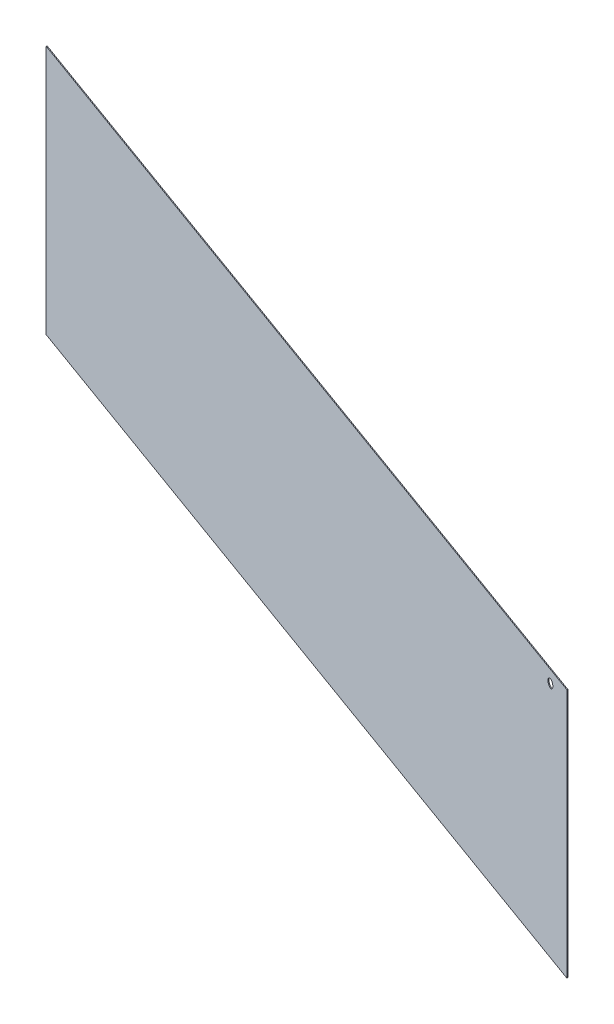
ISO-10303-21;
HEADER;
FILE_DESCRIPTION(('STEP AP214'),'2;1');
FILE_NAME('part.step','',(''),(''),'','','');
FILE_SCHEMA(('AUTOMOTIVE_DESIGN { 1 0 10303 214 1 1 1 1 }'));
ENDSEC;
DATA;
#1=APPLICATION_CONTEXT('core data for automotive mechanical design processes');
#2=APPLICATION_PROTOCOL_DEFINITION('international standard','automotive_design',2000,#1);
#3=PRODUCT_CONTEXT('',#1,'mechanical');
#4=PRODUCT('Part','Part','',(#3));
#5=PRODUCT_RELATED_PRODUCT_CATEGORY('part','',(#4));
#6=PRODUCT_DEFINITION_FORMATION('','',#4);
#7=PRODUCT_DEFINITION_CONTEXT('part definition',#1,'design');
#8=PRODUCT_DEFINITION('design','',#6,#7);
#9=PRODUCT_DEFINITION_SHAPE('','',#8);
#10=(LENGTH_UNIT() NAMED_UNIT(*) SI_UNIT(.MILLI.,.METRE.));
#11=(NAMED_UNIT(*) PLANE_ANGLE_UNIT() SI_UNIT($,.RADIAN.));
#12=(NAMED_UNIT(*) SI_UNIT($,.STERADIAN.) SOLID_ANGLE_UNIT());
#13=UNCERTAINTY_MEASURE_WITH_UNIT(LENGTH_MEASURE(1.E-05),#10,'distance_accuracy_value','');
#14=(GEOMETRIC_REPRESENTATION_CONTEXT(3) GLOBAL_UNCERTAINTY_ASSIGNED_CONTEXT((#13)) GLOBAL_UNIT_ASSIGNED_CONTEXT((#10,
#11,#12)) REPRESENTATION_CONTEXT('',''));
#15=CARTESIAN_POINT('',(0.,0.,0.));
#16=DIRECTION('',(0.,0.,1.));
#17=DIRECTION('',(1.,0.,0.));
#18=AXIS2_PLACEMENT_3D('',#15,#16,#17);
#19=CARTESIAN_POINT('',(-263.158678756476,731.,724.698909751592));
#20=DIRECTION('',(-0.939946705254983,0.,-0.341321243523316));
#21=DIRECTION('',(0.,1.,0.));
#22=AXIS2_PLACEMENT_3D('',#19,#20,#21);
#23=PLANE('',#22);
#24=DIRECTION('',(0.341321243523316,0.,-0.939946705254983));
#25=VECTOR('',#24,1.);
#26=CARTESIAN_POINT('',(-263.158678756476,1041.,724.698909751592));
#27=LINE('',#26,#25);
#28=CARTESIAN_POINT('',(-263.5,1041.,725.638856456847));
#29=VERTEX_POINT('',#28);
#30=CARTESIAN_POINT('',(-262.817357512953,1041.,723.758963046337));
#31=VERTEX_POINT('',#30);
#32=EDGE_CURVE('E11',#29,#31,#27,.T.);
#33=ORIENTED_EDGE('',*,*,#32,.F.);
#34=DIRECTION('',(0.,1.,0.));
#35=VECTOR('',#34,1.);
#36=CARTESIAN_POINT('',(-263.5,731.,725.638856456847));
#37=LINE('',#36,#35);
#38=CARTESIAN_POINT('',(-263.5,421.,725.638856456847));
#39=VERTEX_POINT('',#38);
#40=EDGE_CURVE('E73',#29,#39,#37,.F.);
#41=ORIENTED_EDGE('',*,*,#40,.T.);
#42=DIRECTION('',(0.341321243523316,0.,-0.939946705254983));
#43=VECTOR('',#42,1.);
#44=CARTESIAN_POINT('',(-263.158678756476,421.,724.698909751592));
#45=LINE('',#44,#43);
#46=CARTESIAN_POINT('',(-262.817357512953,421.,723.758963046337));
#47=VERTEX_POINT('',#46);
#48=EDGE_CURVE('E45',#39,#47,#45,.T.);
#49=ORIENTED_EDGE('',*,*,#48,.T.);
#50=DIRECTION('',(0.,1.,0.));
#51=VECTOR('',#50,1.);
#52=CARTESIAN_POINT('',(-262.817357512953,731.,723.758963046337));
#53=LINE('',#52,#51);
#54=EDGE_CURVE('E75',#31,#47,#53,.F.);
#55=ORIENTED_EDGE('',*,*,#54,.F.);
#56=EDGE_LOOP('',(#33,#41,#49,#55));
#57=FACE_BOUND('',#56,.T.);
#58=ADVANCED_FACE('F35',(#57),#23,.F.);
#59=CARTESIAN_POINT('',(-1277.64554520218,421.,356.310024661149));
#60=DIRECTION('',(0.,-1.,0.));
#61=DIRECTION('',(-0.939946705254983,0.,-0.341321243523316));
#62=AXIS2_PLACEMENT_3D('',#59,#60,#61);
#63=PLANE('',#62);
#64=ORIENTED_EDGE('',*,*,#48,.F.);
#65=DIRECTION('',(-0.939946705254983,0.,-0.341321243523316));
#66=VECTOR('',#65,1.);
#67=CARTESIAN_POINT('',(-1277.9868664457,421.,357.249971366404));
#68=LINE('',#67,#66);
#69=CARTESIAN_POINT('',(-2292.47373289141,421.,-11.1389137240406));
#70=VERTEX_POINT('',#69);
#71=EDGE_CURVE('E87',#39,#70,#68,.T.);
#72=ORIENTED_EDGE('',*,*,#71,.T.);
#73=DIRECTION('',(0.341321243523316,0.,-0.939946705254983));
#74=VECTOR('',#73,1.);
#75=CARTESIAN_POINT('',(-2292.13241164788,421.,-12.0788604292956));
#76=LINE('',#75,#74);
#77=CARTESIAN_POINT('',(-2291.79109040436,421.,-13.0188071345506));
#78=VERTEX_POINT('',#77);
#79=EDGE_CURVE('E97',#70,#78,#76,.T.);
#80=ORIENTED_EDGE('',*,*,#79,.T.);
#81=DIRECTION('',(-0.939946705254983,0.,-0.341321243523316));
#82=VECTOR('',#81,1.);
#83=CARTESIAN_POINT('',(-1277.30422395865,421.,355.370077955894));
#84=LINE('',#83,#82);
#85=EDGE_CURVE('E92',#47,#78,#84,.T.);
#86=ORIENTED_EDGE('',*,*,#85,.F.);
#87=EDGE_LOOP('',(#64,#72,#80,#86));
#88=FACE_BOUND('',#87,.T.);
#89=ADVANCED_FACE('F105',(#88),#63,.T.);
#90=CARTESIAN_POINT('',(-2292.13241164788,731.,-12.0788604292956));
#91=DIRECTION('',(-0.939946705254983,0.,-0.341321243523316));
#92=DIRECTION('',(0.,1.,0.));
#93=AXIS2_PLACEMENT_3D('',#90,#91,#92);
#94=PLANE('',#93);
#95=ORIENTED_EDGE('',*,*,#79,.F.);
#96=DIRECTION('',(0.,1.,0.));
#97=VECTOR('',#96,1.);
#98=CARTESIAN_POINT('',(-2292.47373289141,731.,-11.1389137240406));
#99=LINE('',#98,#97);
#100=CARTESIAN_POINT('',(-2292.47373289141,1041.,-11.1389137240406));
#101=VERTEX_POINT('',#100);
#102=EDGE_CURVE('E90',#70,#101,#99,.T.);
#103=ORIENTED_EDGE('',*,*,#102,.T.);
#104=DIRECTION('',(0.341321243523316,0.,-0.939946705254983));
#105=VECTOR('',#104,1.);
#106=CARTESIAN_POINT('',(-2292.13241164788,1041.,-12.0788604292956));
#107=LINE('',#106,#105);
#108=CARTESIAN_POINT('',(-2291.79109040436,1041.,-13.0188071345506));
#109=VERTEX_POINT('',#108);
#110=EDGE_CURVE('E39',#101,#109,#107,.T.);
#111=ORIENTED_EDGE('',*,*,#110,.T.);
#112=DIRECTION('',(0.,1.,0.));
#113=VECTOR('',#112,1.);
#114=CARTESIAN_POINT('',(-2291.79109040436,731.,-13.0188071345506));
#115=LINE('',#114,#113);
#116=EDGE_CURVE('E106',#78,#109,#115,.T.);
#117=ORIENTED_EDGE('',*,*,#116,.F.);
#118=EDGE_LOOP('',(#95,#103,#111,#117));
#119=FACE_BOUND('',#118,.T.);
#120=ADVANCED_FACE('F136',(#119),#94,.T.);
#121=CARTESIAN_POINT('',(-1277.64554520218,1041.,356.310024661149));
#122=DIRECTION('',(0.,-1.,0.));
#123=DIRECTION('',(-0.939946705254983,0.,-0.341321243523316));
#124=AXIS2_PLACEMENT_3D('',#121,#122,#123);
#125=PLANE('',#124);
#126=DIRECTION('',(-0.939946705254983,0.,-0.341321243523316));
#127=VECTOR('',#126,1.);
#128=CARTESIAN_POINT('',(-1277.9868664457,1041.,357.249971366404));
#129=LINE('',#128,#127);
#130=EDGE_CURVE('E85',#101,#29,#129,.F.);
#131=ORIENTED_EDGE('',*,*,#130,.T.);
#132=ORIENTED_EDGE('',*,*,#32,.T.);
#133=DIRECTION('',(-0.939946705254983,0.,-0.341321243523316));
#134=VECTOR('',#133,1.);
#135=CARTESIAN_POINT('',(-1277.30422395865,1041.,355.370077955894));
#136=LINE('',#135,#134);
#137=EDGE_CURVE('E104',#109,#31,#136,.F.);
#138=ORIENTED_EDGE('',*,*,#137,.F.);
#139=ORIENTED_EDGE('',*,*,#110,.F.);
#140=EDGE_LOOP('',(#131,#132,#138,#139));
#141=FACE_BOUND('',#140,.T.);
#142=ADVANCED_FACE('F37',(#141),#125,.F.);
#143=CARTESIAN_POINT('',(-1277.30422395865,731.,355.370077955894));
#144=DIRECTION('',(0.341321243523316,0.,-0.939946705254983));
#145=DIRECTION('',(-0.939946705254983,0.,-0.341321243523316));
#146=AXIS2_PLACEMENT_3D('',#143,#144,#145);
#147=PLANE('',#146);
#148=CARTESIAN_POINT('',(-317.092128893479,1010.99999998338,704.050257908082));
#149=CARTESIAN_POINT('',(-317.092128161649,1010.71659616722,704.05025817383));
#150=CARTESIAN_POINT('',(-317.103506537772,1010.43322357667,704.04612636352));
#151=CARTESIAN_POINT('',(-317.148631822024,1009.86847095922,704.029740096034));
#152=CARTESIAN_POINT('',(-317.182381335126,1009.58709116823,704.017484692918));
#153=CARTESIAN_POINT('',(-317.271919376641,1009.02807023327,703.984970896655));
#154=CARTESIAN_POINT('',(-317.3277249886,1008.75043216023,703.964706299989));
#155=CARTESIAN_POINT('',(-317.427682518127,1008.33840923983,703.92840889282));
#156=CARTESIAN_POINT('',(-317.463730434433,1008.20174475961,703.91531887447));
#157=CARTESIAN_POINT('',(-317.541212650291,1007.93011992083,703.887182889611));
#158=CARTESIAN_POINT('',(-317.582647872337,1007.79515985847,703.872136588118));
#159=CARTESIAN_POINT('',(-317.670792285515,1007.52740143399,703.840128857736));
#160=CARTESIAN_POINT('',(-317.717494486569,1007.39460046825,703.823169967141));
#161=CARTESIAN_POINT('',(-317.816178301854,1007.13123366522,703.787335081652));
#162=CARTESIAN_POINT('',(-317.868160368393,1007.00066802054,703.768458922512));
#163=CARTESIAN_POINT('',(-318.031894195613,1006.61259343861,703.709002537165));
#164=CARTESIAN_POINT('',(-318.151422378144,1006.35874087583,703.665598472158));
#165=CARTESIAN_POINT('',(-318.410048202469,1005.86264158263,703.571684117789));
#166=CARTESIAN_POINT('',(-318.54914526188,1005.62039450711,703.521174039905));
#167=CARTESIAN_POINT('',(-318.845860419548,1005.14912941196,703.413428370899));
#168=CARTESIAN_POINT('',(-319.003476863738,1004.9201102136,703.356193380415));
#169=CARTESIAN_POINT('',(-319.336355009959,1004.47672540254,703.235315907071));
#170=CARTESIAN_POINT('',(-319.511630640618,1004.26237158442,703.171668366331));
#171=CARTESIAN_POINT('',(-319.78684026846,1003.95333569504,703.071731963682));
#172=CARTESIAN_POINT('',(-319.880635575236,1003.85239729882,703.037672233948));
#173=CARTESIAN_POINT('',(-320.072182042798,1003.65486213377,702.968116291962));
#174=CARTESIAN_POINT('',(-320.169933216115,1003.55826537869,702.93262007516));
#175=CARTESIAN_POINT('',(-320.468793861437,1003.27521021298,702.824095318882));
#176=CARTESIAN_POINT('',(-320.675557642118,1003.09543398632,702.749013539944));
#177=CARTESIAN_POINT('',(-321.102495755501,1002.7549080535,702.593980231191));
#178=CARTESIAN_POINT('',(-321.322672139056,1002.59416126815,702.514027956653));
#179=CARTESIAN_POINT('',(-321.775003591509,1002.29270187456,702.349773608005));
#180=CARTESIAN_POINT('',(-322.00716507426,1002.15200014811,702.265469204843));
#181=CARTESIAN_POINT('',(-322.481687809462,1001.89191094672,702.093156573548));
#182=CARTESIAN_POINT('',(-322.724044641728,1001.77251435028,702.00514995051));
#183=CARTESIAN_POINT('',(-323.217468949602,1001.55607832462,701.825973623377));
#184=CARTESIAN_POINT('',(-323.468537823882,1001.45904250459,701.734803411385));
#185=CARTESIAN_POINT('',(-323.977468191237,1001.28773976428,701.549996395326));
#186=CARTESIAN_POINT('',(-324.235330379389,1001.21347518381,701.456359338857));
#187=CARTESIAN_POINT('',(-324.7561878226,1001.08805202408,701.267221264091));
#188=CARTESIAN_POINT('',(-325.019187165829,1001.03691270044,701.171718761263));
#189=CARTESIAN_POINT('',(-325.548303568092,1000.95822050949,700.979581624785));
#190=CARTESIAN_POINT('',(-325.814420393149,1000.9306658834,700.8829470761));
#191=CARTESIAN_POINT('',(-326.21446436982,1000.90731579886,700.737679789329));
#192=CARTESIAN_POINT('',(-326.347974952546,1000.90252997259,700.689198319194));
#193=CARTESIAN_POINT('',(-326.615066365011,1000.89901022711,700.592209870245));
#194=CARTESIAN_POINT('',(-326.748647194494,1000.90027628595,700.543702891525));
#195=CARTESIAN_POINT('',(-327.149132056588,1000.91311956896,700.398275506783));
#196=CARTESIAN_POINT('',(-327.415826947982,1000.93373908036,700.301431045854));
#197=CARTESIAN_POINT('',(-327.946817179762,1000.99869674531,700.108613468861));
#198=CARTESIAN_POINT('',(-328.211110542398,1001.04305291352,700.012641070974));
#199=CARTESIAN_POINT('',(-328.735295427989,1001.15511345028,699.822294707732));
#200=CARTESIAN_POINT('',(-328.995186964743,1001.22281774562,699.727920737368));
#201=CARTESIAN_POINT('',(-329.508735454047,1001.38117843079,699.541436750564));
#202=CARTESIAN_POINT('',(-329.762392112585,1001.47183590072,699.44932684089));
#203=CARTESIAN_POINT('',(-330.261529750697,1001.67578428741,699.268075841894));
#204=CARTESIAN_POINT('',(-330.507011019171,1001.78907440339,699.178934647666));
#205=CARTESIAN_POINT('',(-330.988208211088,1002.037397693,699.004198332291));
#206=CARTESIAN_POINT('',(-331.223918907711,1002.17244232031,698.91860510915));
#207=CARTESIAN_POINT('',(-331.683892712526,1002.46307005795,698.751575606127));
#208=CARTESIAN_POINT('',(-331.90815503167,1002.61865458129,698.670139612769));
#209=CARTESIAN_POINT('',(-332.343648594951,1002.94926532085,698.51199957809));
#210=CARTESIAN_POINT('',(-332.554879577375,1003.12429192734,698.435295631804));
#211=CARTESIAN_POINT('',(-332.96269908564,1003.49266905351,698.287204829511));
#212=CARTESIAN_POINT('',(-333.159288911235,1003.68601794319,698.215817501527));
#213=CARTESIAN_POINT('',(-333.536306623408,1004.08996185856,698.078911702901));
#214=CARTESIAN_POINT('',(-333.716727460116,1004.30056433116,698.013395792266));
#215=CARTESIAN_POINT('',(-334.060239609168,1004.73720500903,697.888656811614));
#216=CARTESIAN_POINT('',(-334.223330291483,1004.96324377499,697.829433970379));
#217=CARTESIAN_POINT('',(-334.53111594785,1005.42907123342,697.717668290067));
#218=CARTESIAN_POINT('',(-334.675810648579,1005.66886013011,697.665125550242));
#219=CARTESIAN_POINT('',(-334.945749135021,1006.16054716471,697.567103248177));
#220=CARTESIAN_POINT('',(-335.070994459263,1006.41244434275,697.521623127254));
#221=CARTESIAN_POINT('',(-335.243382057864,1006.79790203457,697.459024312669));
#222=CARTESIAN_POINT('',(-335.298247706454,1006.92760894668,697.439101043298));
#223=CARTESIAN_POINT('',(-335.402711339229,1007.18939895988,697.401167342544));
#224=CARTESIAN_POINT('',(-335.4523094322,1007.32148201183,697.383156871658));
#225=CARTESIAN_POINT('',(-335.593106431294,1007.72092435791,697.332029497577));
#226=CARTESIAN_POINT('',(-335.676327530054,1007.99152041631,697.301809561961));
#227=CARTESIAN_POINT('',(-335.821066304369,1008.53914563854,697.249250817769));
#228=CARTESIAN_POINT('',(-335.882585076857,1008.81617447647,697.226911610867));
#229=CARTESIAN_POINT('',(-335.983566909157,1009.37475185214,697.19024225038));
#230=CARTESIAN_POINT('',(-336.023030226999,1009.65630033697,697.175912003096));
#231=CARTESIAN_POINT('',(-336.079468658099,1010.22125097256,697.155417611895));
#232=CARTESIAN_POINT('',(-336.096498146009,1010.50464696199,697.149233723003));
#233=CARTESIAN_POINT('',(-336.107786173996,1011.07194714115,697.145134720658));
#234=CARTESIAN_POINT('',(-336.102045456214,1011.35585131402,697.147219337712));
#235=CARTESIAN_POINT('',(-336.068016073833,1011.92210282543,697.159576369282));
#236=CARTESIAN_POINT('',(-336.039728491787,1012.20445023807,697.169848390691));
#237=CARTESIAN_POINT('',(-335.961028658181,1012.76564875072,697.198426527006));
#238=CARTESIAN_POINT('',(-335.91061495897,1013.04449962074,697.216733167595));
#239=CARTESIAN_POINT('',(-335.788104626714,1013.59637876033,697.261220135543));
#240=CARTESIAN_POINT('',(-335.716036049031,1013.86941407714,697.287390275208));
#241=CARTESIAN_POINT('',(-335.550550930165,1014.40804467999,697.347482604103));
#242=CARTESIAN_POINT('',(-335.457136290186,1014.67364062626,697.381404102952));
#243=CARTESIAN_POINT('',(-335.24938183638,1015.19540612313,697.456845623332));
#244=CARTESIAN_POINT('',(-335.135041587089,1015.45157547741,697.498365802992));
#245=CARTESIAN_POINT('',(-334.88654875579,1015.95280065559,697.588600580891));
#246=CARTESIAN_POINT('',(-334.752395427299,1016.19785606028,697.637315450199));
#247=CARTESIAN_POINT('',(-334.465303338533,1016.67523944425,697.741566710612));
#248=CARTESIAN_POINT('',(-334.312360572031,1016.90756469392,697.79710455649));
#249=CARTESIAN_POINT('',(-333.988734627045,1017.35780576833,697.914622293785));
#250=CARTESIAN_POINT('',(-333.818052831824,1017.57572271445,697.976601682899));
#251=CARTESIAN_POINT('',(-333.549569131794,1017.89048550652,698.074095710856));
#252=CARTESIAN_POINT('',(-333.457984376738,1017.99340088842,698.107352726715));
#253=CARTESIAN_POINT('',(-333.270781663038,1018.19498859717,698.175331328771));
#254=CARTESIAN_POINT('',(-333.175163786038,1018.29366100983,698.210052885322));
#255=CARTESIAN_POINT('',(-332.882545106347,1018.58308485759,698.316311007268));
#256=CARTESIAN_POINT('',(-332.67974945434,1018.76727781645,698.389951846411));
#257=CARTESIAN_POINT('',(-332.260123183498,1019.11719573065,698.542330018256));
#258=CARTESIAN_POINT('',(-332.043273100855,1019.28289417033,698.621074418819));
#259=CARTESIAN_POINT('',(-331.597323023962,1019.59445690292,698.783011509447));
#260=CARTESIAN_POINT('',(-331.368223146114,1019.74032138424,698.866204157244));
#261=CARTESIAN_POINT('',(-330.899328746967,1020.01113346444,699.036472980468));
#262=CARTESIAN_POINT('',(-330.65953368646,1020.13608000722,699.123549351698));
#263=CARTESIAN_POINT('',(-330.170835324397,1020.36384287292,699.301009554192));
#264=CARTESIAN_POINT('',(-329.921932281181,1020.46665982296,699.391393291644));
#265=CARTESIAN_POINT('',(-329.416366513573,1020.64978715752,699.574978526337));
#266=CARTESIAN_POINT('',(-329.159689217949,1020.7300519567,699.668185314803));
#267=CARTESIAN_POINT('',(-328.640910234563,1020.86746424848,699.856568641999));
#268=CARTESIAN_POINT('',(-328.378808195309,1020.92461023814,699.951745308366));
#269=CARTESIAN_POINT('',(-327.851020545624,1021.01538902521,700.143399937186));
#270=CARTESIAN_POINT('',(-327.585334822453,1021.04902108113,700.23987794058));
#271=CARTESIAN_POINT('',(-327.052258694891,1021.09235583855,700.433452965349));
#272=CARTESIAN_POINT('',(-326.784868437061,1021.10206057029,700.530549933506));
#273=CARTESIAN_POINT('',(-326.249729360733,1021.09719887564,700.724874073341));
#274=CARTESIAN_POINT('',(-325.981980949891,1021.08258203233,700.82210109699));
#275=CARTESIAN_POINT('',(-325.448586962907,1021.02942641554,701.015791545509));
#276=CARTESIAN_POINT('',(-325.182941464125,1020.99088676611,701.112254942288));
#277=CARTESIAN_POINT('',(-324.655620352762,1020.89027525005,701.303740157844));
#278=CARTESIAN_POINT('',(-324.393944835291,1020.82820282055,701.398761942083));
#279=CARTESIAN_POINT('',(-323.876398714573,1020.68089973753,701.586697581962));
#280=CARTESIAN_POINT('',(-323.620527646152,1020.59567094693,701.679611606519));
#281=CARTESIAN_POINT('',(-323.242496068507,1020.45076037677,701.816885568385));
#282=CARTESIAN_POINT('',(-323.117402685094,1020.39959012229,701.862310515294));
#283=CARTESIAN_POINT('',(-322.869390100598,1020.29160476011,701.952370901991));
#284=CARTESIAN_POINT('',(-322.74647085755,1020.2347897615,701.997006357018));
#285=CARTESIAN_POINT('',(-322.381282829758,1020.05607869379,702.129616462536));
#286=CARTESIAN_POINT('',(-322.142542457703,1019.92590070643,702.216309846548));
#287=CARTESIAN_POINT('',(-321.676245230433,1019.64468452611,702.38563556318));
#288=CARTESIAN_POINT('',(-321.448687546289,1019.49364788251,702.468268196808));
#289=CARTESIAN_POINT('',(-321.006277038231,1019.17179998743,702.628919969843));
#290=CARTESIAN_POINT('',(-320.791423955596,1019.00098913886,702.7069392032));
#291=CARTESIAN_POINT('',(-320.376446638987,1018.64109791113,702.857629208226));
#292=CARTESIAN_POINT('',(-320.176291959683,1018.45205728654,702.930311035456));
#293=CARTESIAN_POINT('',(-319.791876525173,1018.05649556683,703.069903156374));
#294=CARTESIAN_POINT('',(-319.607615469807,1017.84997480198,703.136813559058));
#295=CARTESIAN_POINT('',(-319.256138841683,1017.42106656269,703.264444667407));
#296=CARTESIAN_POINT('',(-319.088926389385,1017.19867619622,703.325164239945));
#297=CARTESIAN_POINT('',(-318.772613804154,1016.7397548389,703.440026289388));
#298=CARTESIAN_POINT('',(-318.623514365651,1016.50322330643,703.494168514126));
#299=CARTESIAN_POINT('',(-318.3447281236,1016.01809994615,703.595403686591));
#300=CARTESIAN_POINT('',(-318.215008592681,1015.76952941113,703.642508518552));
#301=CARTESIAN_POINT('',(-317.975770282847,1015.26161197463,703.72938271786));
#302=CARTESIAN_POINT('',(-317.866251322381,1015.00226517001,703.769152151133));
#303=CARTESIAN_POINT('',(-317.66852803394,1014.47485335208,703.840951071548));
#304=CARTESIAN_POINT('',(-317.580300946772,1014.20679799846,703.872988823195));
#305=CARTESIAN_POINT('',(-317.425352731284,1013.66382788659,703.929254904342));
#306=CARTESIAN_POINT('',(-317.358627304977,1013.38891451105,703.953484794562));
#307=CARTESIAN_POINT('',(-317.233094012594,1012.76481456179,703.999069484864));
#308=CARTESIAN_POINT('',(-317.180417210483,1012.4142132409,704.018197922149));
#309=CARTESIAN_POINT('',(-317.10993567671,1011.70905823541,704.043791761266));
#310=CARTESIAN_POINT('',(-317.092129808911,1011.35450467996,704.050257575663));
#311=CARTESIAN_POINT('',(-317.092128893479,1010.99999998338,704.050257908082));
#312=B_SPLINE_CURVE_WITH_KNOTS('',3,(#148,#149,#150,#151,#152,#153,#154,#155,#156,#157,#158,
#159,#160,#161,#162,#163,#164,#165,#166,#167,#168,#169,#170,#171,#172,#173,#174,#175,#176,#177,
#178,#179,#180,#181,#182,#183,#184,#185,#186,#187,#188,#189,#190,#191,#192,#193,#194,#195,#196,
#197,#198,#199,#200,#201,#202,#203,#204,#205,#206,#207,#208,#209,#210,#211,#212,#213,#214,#215,
#216,#217,#218,#219,#220,#221,#222,#223,#224,#225,#226,#227,#228,#229,#230,#231,#232,#233,#234,
#235,#236,#237,#238,#239,#240,#241,#242,#243,#244,#245,#246,#247,#248,#249,#250,#251,#252,#253,
#254,#255,#256,#257,#258,#259,#260,#261,#262,#263,#264,#265,#266,#267,#268,#269,#270,#271,#272,
#273,#274,#275,#276,#277,#278,#279,#280,#281,#282,#283,#284,#285,#286,#287,#288,#289,#290,#291,
#292,#293,#294,#295,#296,#297,#298,#299,#300,#301,#302,#303,#304,#305,#306,#307,#308,#309,#310,
#311),.UNSPECIFIED.,.T.,.F.,(4,2,2,2,2,2,2,2,2,2,2,2,2,2,2,2,2,2,2,2,2,2,2,2,2,2,2,2,2,2,2,2,2,
2,2,2,2,2,2,2,2,2,2,2,2,2,2,2,2,2,2,2,2,2,2,2,2,2,2,2,2,2,2,2,2,2,2,2,2,2,2,2,2,2,2,2,2,2,2,2,2,
4),(0.,0.849903612188225,1.69990620756345,2.55056846663361,2.97629584769409,3.40209622423687,
3.82733800551127,4.25261624653498,5.1032805281523,5.95391949885581,6.80448255202098,
7.65572181581751,8.08142153469556,8.50712260216781,9.35830663396736,10.2096211442041,
11.0613960579151,11.9128054163046,12.7643521020784,13.6159862573352,14.4683282401125,
15.320606656278,15.746859173148,16.1731101431514,17.025457611008,17.8784528779694,
18.7314454707499,19.5844782104716,20.4374807739225,21.2909339167457,22.1444458022665,
22.9979748235938,23.851427983165,24.7052514661039,25.5591059786793,26.4129731761003,
27.2667727945287,27.6933682691573,28.1199549320331,28.9729839908427,29.8259699275827,
30.6789458848677,31.5298505894648,32.3807275610675,33.2315636816117,34.0824554782872,
34.9322496056321,35.7819680748062,36.6317042286946,37.4814724056511,38.3314220830594,
39.1813055323269,39.6063633274869,40.0314125222145,40.8813698898779,41.7325306020855,
42.5836832276821,43.4348788136275,44.2860502747895,45.1389300554336,45.9918652719403,
46.8448273839896,47.6977171198486,48.552377039934,49.4070682554679,50.2617799147593,
51.1164228330605,51.5440618928181,51.9716926891628,52.8268146498186,53.6818731277056,
54.5369141868374,55.3901310589254,56.2433318139955,57.0966884538117,57.9500777998941,
58.8020093062761,59.653933155571,60.5049422970856,61.3557812239131,62.4189448865589,
63.482073909485),.UNSPECIFIED.);
#313=CARTESIAN_POINT('',(-336.104255878079,1011.,697.146416670991));
#314=VERTEX_POINT('',#313);
#315=EDGE_CURVE('E88',#314,#314,#312,.F.);
#316=ORIENTED_EDGE('',*,*,#315,.T.);
#317=EDGE_LOOP('',(#316));
#318=FACE_BOUND('',#317,.T.);
#319=ORIENTED_EDGE('',*,*,#116,.T.);
#320=ORIENTED_EDGE('',*,*,#137,.T.);
#321=ORIENTED_EDGE('',*,*,#54,.T.);
#322=ORIENTED_EDGE('',*,*,#85,.T.);
#323=EDGE_LOOP('',(#319,#320,#321,#322));
#324=FACE_BOUND('',#323,.T.);
#325=ADVANCED_FACE('F103',(#318,#324),#147,.T.);
#326=CARTESIAN_POINT('',(-1277.9868664457,731.,357.249971366404));
#327=DIRECTION('',(0.341321243523316,0.,-0.939946705254983));
#328=DIRECTION('',(-0.939946705254983,0.,-0.341321243523316));
#329=AXIS2_PLACEMENT_3D('',#326,#327,#328);
#330=PLANE('',#329);
#331=CARTESIAN_POINT('',(-317.799399894847,1010.99999998653,705.921208008203));
#332=CARTESIAN_POINT('',(-317.799399186695,1011.28411728597,705.921208265353));
#333=CARTESIAN_POINT('',(-317.810801326814,1011.56820364509,705.917067825664));
#334=CARTESIAN_POINT('',(-317.856028662913,1012.13437877143,705.900644500264));
#335=CARTESIAN_POINT('',(-317.889856408005,1012.41646730788,705.888360688899));
#336=CARTESIAN_POINT('',(-317.979612716784,1012.97689633773,705.855767633617));
#337=CARTESIAN_POINT('',(-318.035558449898,1013.25523374526,705.835452154995));
#338=CARTESIAN_POINT('',(-318.135777641151,1013.66829265065,705.799059731051));
#339=CARTESIAN_POINT('',(-318.171921643927,1013.80530114366,705.785934820984));
#340=CARTESIAN_POINT('',(-318.249613877424,1014.07760804691,705.757722572778));
#341=CARTESIAN_POINT('',(-318.291163035349,1014.21290615937,705.742634897944));
#342=CARTESIAN_POINT('',(-318.37955582601,1014.48133931866,705.71053697467));
#343=CARTESIAN_POINT('',(-318.426392703836,1014.6144768822,705.693529179129));
#344=CARTESIAN_POINT('',(-318.525364771356,1014.87850793928,705.657589621097));
#345=CARTESIAN_POINT('',(-318.577500417594,1015.00940123832,705.638657692823));
#346=CARTESIAN_POINT('',(-318.741720952844,1015.39844644927,705.579024570019));
#347=CARTESIAN_POINT('',(-318.861607912249,1015.65292869228,705.535490222978));
#348=CARTESIAN_POINT('',(-319.121026460545,1016.15022851168,705.441288008105));
#349=CARTESIAN_POINT('',(-319.26055717876,1016.39304660443,705.39062045644));
#350=CARTESIAN_POINT('',(-319.558234910944,1016.86538066138,705.282525249393));
#351=CARTESIAN_POINT('',(-319.716380039599,1017.09489796921,705.225098278621));
#352=CARTESIAN_POINT('',(-320.050100216321,1017.53879386518,705.103915040177));
#353=CARTESIAN_POINT('',(-320.2256601222,1017.75318533243,705.040164271062));
#354=CARTESIAN_POINT('',(-320.593318276606,1018.1652728041,704.90665719268));
#355=CARTESIAN_POINT('',(-320.785416446562,1018.36296888782,704.836900911945));
#356=CARTESIAN_POINT('',(-321.184656011562,1018.74033547874,704.691925729812));
#357=CARTESIAN_POINT('',(-321.39179745921,1018.9200059229,704.616706809312));
#358=CARTESIAN_POINT('',(-321.819515453321,1019.26024080244,704.461390303801));
#359=CARTESIAN_POINT('',(-322.040092458951,1019.42080458428,704.381292552052));
#360=CARTESIAN_POINT('',(-322.492654242737,1019.72138043985,704.21695456358));
#361=CARTESIAN_POINT('',(-322.724614398409,1019.86143446968,704.132723267976));
#362=CARTESIAN_POINT('',(-323.198815359531,1020.1202555827,703.960527481954));
#363=CARTESIAN_POINT('',(-323.44105633727,1020.23902230897,703.872562928973));
#364=CARTESIAN_POINT('',(-323.934171319395,1020.45412266998,703.693498926771));
#365=CARTESIAN_POINT('',(-324.185044991298,1020.55045716757,703.602399598286));
#366=CARTESIAN_POINT('',(-324.693525445504,1020.72031722678,703.417755958421));
#367=CARTESIAN_POINT('',(-324.951132421855,1020.79384213026,703.324211576578));
#368=CARTESIAN_POINT('',(-325.470815253427,1020.91759379926,703.135500036532));
#369=CARTESIAN_POINT('',(-325.732883580249,1020.96785642462,703.040335612104));
#370=CARTESIAN_POINT('',(-326.260073633149,1021.04485461874,702.848897987584));
#371=CARTESIAN_POINT('',(-326.525195111752,1021.07159208093,702.752624877358));
#372=CARTESIAN_POINT('',(-326.923700455243,1021.09375458662,702.607916311829));
#373=CARTESIAN_POINT('',(-327.056690435391,1021.09815086695,702.55962388722));
#374=CARTESIAN_POINT('',(-327.322723652255,1021.10090416718,702.463019699035));
#375=CARTESIAN_POINT('',(-327.455766888064,1021.09926128599,702.414707935788));
#376=CARTESIAN_POINT('',(-327.854619321026,1021.08531678305,702.269873332252));
#377=CARTESIAN_POINT('',(-328.120197060705,1021.0640018368,702.17343454072));
#378=CARTESIAN_POINT('',(-328.648582904087,1020.99777450262,701.981562690843));
#379=CARTESIAN_POINT('',(-328.911392155856,1020.95287232341,701.886129215603));
#380=CARTESIAN_POINT('',(-329.43257272356,1020.83986523263,701.69687380519));
#381=CARTESIAN_POINT('',(-329.690944070065,1020.77176048096,701.603051858917));
#382=CARTESIAN_POINT('',(-330.201430155521,1020.61274888626,701.417679917598));
#383=CARTESIAN_POINT('',(-330.453544596595,1020.52184095991,701.32613003072));
#384=CARTESIAN_POINT('',(-330.949589450498,1020.31754663473,701.146002109178));
#385=CARTESIAN_POINT('',(-331.193520136752,1020.20416098779,701.057423975227));
#386=CARTESIAN_POINT('',(-331.671773202721,1019.95574484595,700.883756755285));
#387=CARTESIAN_POINT('',(-331.906084428445,1019.82069006846,700.798671719624));
#388=CARTESIAN_POINT('',(-332.363280971197,1019.53019616276,700.632650719035));
#389=CARTESIAN_POINT('',(-332.586165502061,1019.37475563459,700.551715039585));
#390=CARTESIAN_POINT('',(-333.018949951962,1019.04459418574,700.394558760626));
#391=CARTESIAN_POINT('',(-333.228849528883,1018.8698727574,700.318338285349));
#392=CARTESIAN_POINT('',(-333.634077530414,1018.50227293029,700.171188532475));
#393=CARTESIAN_POINT('',(-333.829407220427,1018.30939611164,700.100258795374));
#394=CARTESIAN_POINT('',(-334.204380344088,1017.90615665292,699.964095444686));
#395=CARTESIAN_POINT('',(-334.38398414536,1017.69575230193,699.898876222735));
#396=CARTESIAN_POINT('',(-334.725913257127,1017.25960665067,699.774712087713));
#397=CARTESIAN_POINT('',(-334.888237896606,1017.03386475534,699.715767418306));
#398=CARTESIAN_POINT('',(-335.194565591489,1016.56872849132,699.604531165061));
#399=CARTESIAN_POINT('',(-335.338568216652,1016.32933380223,699.552239737455));
#400=CARTESIAN_POINT('',(-335.607219913166,1015.83853150057,699.454684705221));
#401=CARTESIAN_POINT('',(-335.731870449131,1015.58712479898,699.409420568751));
#402=CARTESIAN_POINT('',(-335.903598015351,1015.20215749809,699.347061430598));
#403=CARTESIAN_POINT('',(-335.958339372054,1015.07241137659,699.327183295128));
#404=CARTESIAN_POINT('',(-336.062562696959,1014.81055274094,699.289336856961));
#405=CARTESIAN_POINT('',(-336.11204477188,1014.67844027487,699.271368515511));
#406=CARTESIAN_POINT('',(-336.252506365211,1014.27892297775,699.220362936754));
#407=CARTESIAN_POINT('',(-336.335520621187,1014.00829479383,699.190218111604));
#408=CARTESIAN_POINT('',(-336.479888206407,1013.46063198257,699.137794156675));
#409=CARTESIAN_POINT('',(-336.541242404135,1013.18359761258,699.115514711525));
#410=CARTESIAN_POINT('',(-336.641945372921,1012.6250317164,699.07894661427));
#411=CARTESIAN_POINT('',(-336.681294365724,1012.34350023556,699.064657881642));
#412=CARTESIAN_POINT('',(-336.737620062737,1011.77803477887,699.044204427378));
#413=CARTESIAN_POINT('',(-336.75460657763,1011.49410191159,699.038036143205));
#414=CARTESIAN_POINT('',(-336.765788733033,1010.92573290857,699.03397558619));
#415=CARTESIAN_POINT('',(-336.759985059764,1010.64129678824,699.036083064163));
#416=CARTESIAN_POINT('',(-336.725807278462,1010.07398455068,699.04849398358));
#417=CARTESIAN_POINT('',(-336.69743410532,1009.79110836932,699.058797085538));
#418=CARTESIAN_POINT('',(-336.618531131523,1009.22886027591,699.087448987803));
#419=CARTESIAN_POINT('',(-336.567999926946,1008.94948858704,699.105798297915));
#420=CARTESIAN_POINT('',(-336.4451734783,1008.39638633699,699.150400056669));
#421=CARTESIAN_POINT('',(-336.372891125779,1008.12265253671,699.176647824026));
#422=CARTESIAN_POINT('',(-336.206901500634,1007.58265475522,699.236923353425));
#423=CARTESIAN_POINT('',(-336.113196079183,1007.31639013082,699.270950443254));
#424=CARTESIAN_POINT('',(-335.904790598155,1006.79332534126,699.346628370039));
#425=CARTESIAN_POINT('',(-335.790090146792,1006.53652535282,699.388279349263));
#426=CARTESIAN_POINT('',(-335.540802649289,1006.03408943659,699.478802692945));
#427=CARTESIAN_POINT('',(-335.406214909081,1005.78845389883,699.527675309439));
#428=CARTESIAN_POINT('',(-335.118320367755,1005.31023421562,699.63221796308));
#429=CARTESIAN_POINT('',(-334.965029436438,1005.07763924642,699.687882237454));
#430=CARTESIAN_POINT('',(-334.640651264032,1004.62692223748,699.805673129808));
#431=CARTESIAN_POINT('',(-334.469565457887,1004.40879903308,699.86779922672));
#432=CARTESIAN_POINT('',(-334.200429377221,1004.09379394956,699.965530152544));
#433=CARTESIAN_POINT('',(-334.108619849885,1003.99080942539,699.998868789578));
#434=CARTESIAN_POINT('',(-333.920953215343,1003.78910664147,700.067015854419));
#435=CARTESIAN_POINT('',(-333.825096186925,1003.69038829876,700.101824253615));
#436=CARTESIAN_POINT('',(-333.531743514665,1003.40085862185,700.208348909031));
#437=CARTESIAN_POINT('',(-333.328436589706,1003.21663791002,700.282175405848));
#438=CARTESIAN_POINT('',(-332.90824263259,1002.86719189728,700.434759720642));
#439=CARTESIAN_POINT('',(-332.691368867749,1002.70194847311,700.51351272088));
#440=CARTESIAN_POINT('',(-332.245386015,1002.39133612179,700.675461713349));
#441=CARTESIAN_POINT('',(-332.016277124244,1002.24596687452,700.758657633988));
#442=CARTESIAN_POINT('',(-331.54737600085,1001.97620937355,700.928928898977));
#443=CARTESIAN_POINT('',(-331.307583332832,1001.85182197587,701.016004401427));
#444=CARTESIAN_POINT('',(-330.818903534962,1001.62525812678,701.193457862736));
#445=CARTESIAN_POINT('',(-330.570016638051,1001.52308110694,701.283835737008));
#446=CARTESIAN_POINT('',(-330.065160026951,1001.34152744536,701.467163456908));
#447=CARTESIAN_POINT('',(-329.809194208459,1001.26213852616,701.560111887897));
#448=CARTESIAN_POINT('',(-329.291900271812,1001.12643618114,701.747955952605));
#449=CARTESIAN_POINT('',(-329.030571826891,1001.07012416589,701.842851704981));
#450=CARTESIAN_POINT('',(-328.504391861241,1000.98097654588,702.033922538241));
#451=CARTESIAN_POINT('',(-328.239540253314,1000.94814152327,702.130097650788));
#452=CARTESIAN_POINT('',(-327.708190671987,1000.90637867223,702.323045717769));
#453=CARTESIAN_POINT('',(-327.441692841838,1000.89744879217,702.419818620184));
#454=CARTESIAN_POINT('',(-326.908805847256,1000.9038196647,702.613324965417));
#455=CARTESIAN_POINT('',(-326.6424168279,1000.91913402789,702.710058355555));
#456=CARTESIAN_POINT('',(-326.111791416508,1000.97355605116,702.902743455942));
#457=CARTESIAN_POINT('',(-325.847555104075,1001.01266458709,702.998695137287));
#458=CARTESIAN_POINT('',(-325.32309161715,1001.11428192401,703.189142668556));
#459=CARTESIAN_POINT('',(-325.062864533742,1001.17679125582,703.283638485404));
#460=CARTESIAN_POINT('',(-324.54824298541,1001.32482939728,703.470512130302));
#461=CARTESIAN_POINT('',(-324.293848043295,1001.41035631625,703.562890131633));
#462=CARTESIAN_POINT('',(-323.918023212077,1001.55561481243,703.699362761433));
#463=CARTESIAN_POINT('',(-323.793655296461,1001.60688901724,703.744524270458));
#464=CARTESIAN_POINT('',(-323.547096114918,1001.7150466899,703.83405688542));
#465=CARTESIAN_POINT('',(-323.424904807523,1001.77193005074,703.878428006415));
#466=CARTESIAN_POINT('',(-323.061899745863,1001.95078845413,704.010245415166));
#467=CARTESIAN_POINT('',(-322.824614140175,1002.08098757397,704.096410532349));
#468=CARTESIAN_POINT('',(-322.361203944579,1002.36208522552,704.264687886095));
#469=CARTESIAN_POINT('',(-322.135078561028,1002.51298228243,704.346800410852));
#470=CARTESIAN_POINT('',(-321.695487556167,1002.83438199275,704.506428342502));
#471=CARTESIAN_POINT('',(-321.482021689074,1003.00488426533,704.583943838645));
#472=CARTESIAN_POINT('',(-321.069450372241,1003.36424158074,704.733760157077));
#473=CARTESIAN_POINT('',(-320.870334850964,1003.5530835293,704.806064636626));
#474=CARTESIAN_POINT('',(-320.487945531625,1003.94812111373,704.944921017798));
#475=CARTESIAN_POINT('',(-320.304671440776,1004.15431642871,705.011473025741));
#476=CARTESIAN_POINT('',(-319.955094235953,1004.58245108281,705.138414399747));
#477=CARTESIAN_POINT('',(-319.788794401652,1004.80439345049,705.198802574868));
#478=CARTESIAN_POINT('',(-319.474210860174,1005.26229774202,705.313036759603));
#479=CARTESIAN_POINT('',(-319.325927873696,1005.49826022614,705.366882507511));
#480=CARTESIAN_POINT('',(-319.04831421396,1005.9827190037,705.46769188216));
#481=CARTESIAN_POINT('',(-318.918997199121,1006.23122415837,705.514650549143));
#482=CARTESIAN_POINT('',(-318.680512169319,1006.73895332302,705.601251211158));
#483=CARTESIAN_POINT('',(-318.571344017539,1006.9981772602,705.640893255872));
#484=CARTESIAN_POINT('',(-318.37426924781,1007.52525088268,705.712456680793));
#485=CARTESIAN_POINT('',(-318.28633673565,1007.79308960686,705.74438746392));
#486=CARTESIAN_POINT('',(-318.13187240687,1008.33567272725,705.800477832113));
#487=CARTESIAN_POINT('',(-318.065343304575,1008.61041799456,705.82463643153));
#488=CARTESIAN_POINT('',(-317.940088582295,1009.234496211,705.870119965146));
#489=CARTESIAN_POINT('',(-317.887510896763,1009.58524473017,705.889212410395));
#490=CARTESIAN_POINT('',(-317.817167490009,1010.29067830508,705.914756091683));
#491=CARTESIAN_POINT('',(-317.799400778766,1010.64536324857,705.921207687227));
#492=CARTESIAN_POINT('',(-317.799399894847,1010.99999998653,705.921208008203));
#493=B_SPLINE_CURVE_WITH_KNOTS('',3,(#331,#332,#333,#334,#335,#336,#337,#338,#339,#340,#341,
#342,#343,#344,#345,#346,#347,#348,#349,#350,#351,#352,#353,#354,#355,#356,#357,#358,#359,#360,
#361,#362,#363,#364,#365,#366,#367,#368,#369,#370,#371,#372,#373,#374,#375,#376,#377,#378,#379,
#380,#381,#382,#383,#384,#385,#386,#387,#388,#389,#390,#391,#392,#393,#394,#395,#396,#397,#398,
#399,#400,#401,#402,#403,#404,#405,#406,#407,#408,#409,#410,#411,#412,#413,#414,#415,#416,#417,
#418,#419,#420,#421,#422,#423,#424,#425,#426,#427,#428,#429,#430,#431,#432,#433,#434,#435,#436,
#437,#438,#439,#440,#441,#442,#443,#444,#445,#446,#447,#448,#449,#450,#451,#452,#453,#454,#455,
#456,#457,#458,#459,#460,#461,#462,#463,#464,#465,#466,#467,#468,#469,#470,#471,#472,#473,#474,
#475,#476,#477,#478,#479,#480,#481,#482,#483,#484,#485,#486,#487,#488,#489,#490,#491,#492),
.UNSPECIFIED.,.T.,.F.,(4,2,2,2,2,2,2,2,2,2,2,2,2,2,2,2,2,2,2,2,2,2,2,2,2,2,2,2,2,2,2,2,2,2,2,2,
2,2,2,2,2,2,2,2,2,2,2,2,2,2,2,2,2,2,2,2,2,2,2,2,2,2,2,2,2,2,2,2,2,2,2,2,2,2,2,2,2,2,2,2,4),(0.,
0.852043921517747,1.7041847112132,2.55698829118756,2.98379175244797,3.41066852470931,
3.83700601647911,4.26338027277288,5.1162396319517,5.96906120151699,6.82179646942866,
7.67379667533706,8.5257928337169,9.3777919716049,10.2298202434478,11.0800804436583,
11.9303548984663,12.7805966420325,13.6308629159271,14.4798140644406,15.3286968785998,
15.7532508221572,16.1777978130504,17.0267458447517,17.8753267482487,18.7239018042065,
19.5725171817109,20.4211041782869,21.2706488361238,22.12025186503,22.9698772689699,
23.8194287962955,24.6710631838228,25.5227306314661,26.3744180743772,27.2260410280677,
27.6525815119996,28.0791133392066,28.9320331904747,29.7849188390579,30.6377958929613,
31.4902986547946,32.3427757476852,33.195217530438,34.0477133312541,34.8997048636688,
35.7516228031184,36.60355664177,37.4555202200041,38.3067658632322,39.157942916798,
39.5836437892622,40.009336378972,40.8605811760534,41.7110061554048,42.5614174354433,
43.4118634028031,44.2622876020901,45.1122527575121,45.9622698593433,46.8123080382886,
47.6622732618886,48.5127158212654,49.3631896867023,50.2136828452663,51.0641061655348,
51.489698015451,51.9152817484943,52.7663113983212,53.6172804410477,54.4682329569268,
55.3185823104921,56.1689159442408,57.0194135650078,57.8699451956013,58.7210863635706,
59.5722217518439,60.4223139863098,61.2725139848528,62.3360700282926,63.399595823852),.UNSPECIFIED.);
#494=CARTESIAN_POINT('',(-336.762269850539,1011.,699.035253391986));
#495=VERTEX_POINT('',#494);
#496=EDGE_CURVE('E111',#495,#495,#493,.F.);
#497=ORIENTED_EDGE('',*,*,#496,.T.);
#498=EDGE_LOOP('',(#497));
#499=FACE_BOUND('',#498,.T.);
#500=ORIENTED_EDGE('',*,*,#102,.F.);
#501=ORIENTED_EDGE('',*,*,#71,.F.);
#502=ORIENTED_EDGE('',*,*,#40,.F.);
#503=ORIENTED_EDGE('',*,*,#130,.F.);
#504=EDGE_LOOP('',(#500,#501,#502,#503));
#505=FACE_BOUND('',#504,.T.);
#506=ADVANCED_FACE('F84',(#499,#505),#330,.F.);
#507=CARTESIAN_POINT('',(-336.104255878079,1011.,697.146416670991));
#508=CARTESIAN_POINT('',(-336.762269850539,1011.,699.035253391986));
#509=CARTESIAN_POINT('',(-336.104255880495,1009.67722516666,697.146416670114));
#510=CARTESIAN_POINT('',(-336.76226985289,1009.67899011955,699.035253391133));
#511=CARTESIAN_POINT('',(-335.856377124254,1008.3543902072,697.236428459985));
#512=CARTESIAN_POINT('',(-336.515777694122,1008.35792019309,699.124761668228));
#513=CARTESIAN_POINT('',(-334.903109992148,1005.91094594469,697.582586727386));
#514=CARTESIAN_POINT('',(-335.566949867871,1005.9163084239,699.469307898068));
#515=CARTESIAN_POINT('',(-334.197670752047,1004.79020686835,697.838751675159));
#516=CARTESIAN_POINT('',(-334.864561967211,1004.79563758739,699.724364818156));
#517=CARTESIAN_POINT('',(-332.437595869596,1002.92142560087,698.477884664523));
#518=CARTESIAN_POINT('',(-333.110208063801,1002.92561938285,700.361420358161));
#519=CARTESIAN_POINT('',(-331.382828635026,1002.17324218225,698.860900490972));
#520=CARTESIAN_POINT('',(-332.058109160018,1002.17613254458,700.743467238203));
#521=CARTESIAN_POINT('',(-329.08483477498,1001.16255700256,699.695367080976));
#522=CARTESIAN_POINT('',(-329.764348472262,1001.16334967345,701.576396643575));
#523=CARTESIAN_POINT('',(-326.598194914794,1000.63745560869,700.59833637118));
#524=CARTESIAN_POINT('',(-327.280837394754,1000.63666297404,702.478229784263));
#525=CARTESIAN_POINT('',(-324.111554835963,1001.1625556471,701.50130574078));
#526=CARTESIAN_POINT('',(-324.797326098179,1001.16334831798,703.3800630045));
#527=CARTESIAN_POINT('',(-321.813560747057,1002.17323936919,702.335772413889));
#528=CARTESIAN_POINT('',(-322.503565183572,1002.17612972873,704.212992492249));
#529=CARTESIAN_POINT('',(-320.75879320493,1002.92142209821,702.718788352021));
#530=CARTESIAN_POINT('',(-321.451465971618,1002.92561587733,704.595039484196));
#531=CARTESIAN_POINT('',(-318.99871739391,1004.790202189,703.357921678574));
#532=CARTESIAN_POINT('',(-319.697111139817,1004.79563290811,705.232095361326));
#533=CARTESIAN_POINT('',(-318.293277561749,1005.91094078136,703.614086841342));
#534=CARTESIAN_POINT('',(-318.994722647997,1005.9163032637,705.487152496081));
#535=CARTESIAN_POINT('',(-317.340008656114,1008.35438557951,703.960245752761));
#536=CARTESIAN_POINT('',(-318.045893053747,1008.35791557426,705.83169936793));
#537=CARTESIAN_POINT('',(-316.844260928135,1010.99999781879,704.140265779473));
#538=CARTESIAN_POINT('',(-317.552918466943,1010.99999782548,706.010712388619));
#539=CARTESIAN_POINT('',(-317.340007600309,1013.64561029136,703.960246136153));
#540=CARTESIAN_POINT('',(-318.045892004454,1013.64208030706,705.831699748958));
#541=CARTESIAN_POINT('',(-318.293275601277,1016.08905564619,703.614087553244));
#542=CARTESIAN_POINT('',(-318.994720696351,1016.08369316769,705.487153204779));
#543=CARTESIAN_POINT('',(-318.998715066141,1017.20979463631,703.357922523853));
#544=CARTESIAN_POINT('',(-319.697108821448,1017.20436391821,705.232096203192));
#545=CARTESIAN_POINT('',(-320.758790006188,1019.07857525525,702.718789513574));
#546=CARTESIAN_POINT('',(-321.451462782905,1019.07438147483,704.595040642108));
#547=CARTESIAN_POINT('',(-321.813556940241,1019.826758262,702.335773796252));
#548=CARTESIAN_POINT('',(-322.503561387009,1019.82386790087,704.212993870888));
#549=CARTESIAN_POINT('',(-324.111550453248,1020.83744313288,701.501307332267));
#550=CARTESIAN_POINT('',(-324.797321726492,1020.83665046175,703.380064591983));
#551=CARTESIAN_POINT('',(-326.598190606975,1021.36254443564,700.598337935471));
#552=CARTESIAN_POINT('',(-327.280833097369,1021.36333707034,702.478231344765));
#553=CARTESIAN_POINT('',(-329.084830937953,1020.83744410211,699.695368474309));
#554=CARTESIAN_POINT('',(-329.76434464584,1020.83665143123,701.576398033058));
#555=CARTESIAN_POINT('',(-331.382825176125,1019.82675994033,698.860901746997));
#556=CARTESIAN_POINT('',(-332.058105709358,1019.82386958031,700.743468491235));
#557=CARTESIAN_POINT('',(-332.437592658028,1019.07857702346,698.477885830734));
#558=CARTESIAN_POINT('',(-333.110204861197,1019.07438324359,700.361421521117));
#559=CARTESIAN_POINT('',(-334.197668296582,1017.20979656429,697.838752566808));
#560=CARTESIAN_POINT('',(-334.864559520846,1017.20436584506,699.7243657065));
#561=CARTESIAN_POINT('',(-334.903108008798,1016.08905777832,697.582587447596));
#562=CARTESIAN_POINT('',(-335.566947892926,1016.08369529679,699.469308615227));
#563=CARTESIAN_POINT('',(-335.856376598216,1013.64561258648,697.236428651004));
#564=CARTESIAN_POINT('',(-336.515777171232,1013.64208259663,699.124761858105));
#565=CARTESIAN_POINT('',(-336.104255875664,1012.32277621399,697.146416671868));
#566=CARTESIAN_POINT('',(-336.762269848189,1012.32101125926,699.03525339284));
#567=CARTESIAN_POINT('',(-336.104255878079,1011.,697.146416670991));
#568=CARTESIAN_POINT('',(-336.762269850539,1011.,699.035253391986));
#569=B_SPLINE_SURFACE_WITH_KNOTS('',3,1,((#507,#508),(#509,#510),(#511,#512),(#513,#514),(#515,
#516),(#517,#518),(#519,#520),(#521,#522),(#523,#524),(#525,#526),(#527,#528),(#529,#530),(#531,
#532),(#533,#534),(#535,#536),(#537,#538),(#539,#540),(#541,#542),(#543,#544),(#545,#546),(#547,
#548),(#549,#550),(#551,#552),(#553,#554),(#555,#556),(#557,#558),(#559,#560),(#561,#562),(#563,
#564),(#565,#566),(#567,#568)),.UNSPECIFIED.,.T.,.F.,.F.,(4,1,1,1,1,1,1,1,1,1,1,1,1,1,1,1,1,1,1,
1,1,1,1,1,1,1,1,1,4),(2,2),(0.,0.0624984635538183,0.0625013052917099,0.124997897866677,
0.125001915885879,0.187498537576663,0.187501378681032,0.249999962469933,0.312498535463966,
0.312501376258774,0.374997993631565,0.375002011350912,0.437498602494458,0.437501443892559,
0.499999965948985,0.562498490583834,0.562501332212789,0.624997927216791,0.625001945755353,
0.687498545331677,0.687501386340276,0.749999971018993,0.812498556541371,0.812501397391238,
0.8749980169154,0.875002034673597,0.937498629743175,0.937501471212995,1.),(0.,1.),.UNSPECIFIED.);
#570=CARTESIAN_POINT('',(-336.104255878079,1011.,697.146416670991));
#571=CARTESIAN_POINT('',(-336.111110190293,1011.,697.166092053501));
#572=CARTESIAN_POINT('',(-336.117964502506,1011.,697.185767436012));
#573=CARTESIAN_POINT('',(-336.131673126932,1011.,697.225118201032));
#574=CARTESIAN_POINT('',(-336.138527439145,1011.,697.244793583543));
#575=CARTESIAN_POINT('',(-336.152236063571,1011.,697.284144348563));
#576=CARTESIAN_POINT('',(-336.159090375784,1011.,697.303819731074));
#577=CARTESIAN_POINT('',(-336.172799000211,1011.,697.343170496095));
#578=CARTESIAN_POINT('',(-336.179653312424,1011.,697.362845878605));
#579=CARTESIAN_POINT('',(-336.19336193685,1011.,697.402196643626));
#580=CARTESIAN_POINT('',(-336.200216249063,1011.,697.421872026136));
#581=CARTESIAN_POINT('',(-336.213924873489,1011.,697.461222791157));
#582=CARTESIAN_POINT('',(-336.220779185703,1011.,697.480898173667));
#583=CARTESIAN_POINT('',(-336.234487810129,1011.,697.520248938688));
#584=CARTESIAN_POINT('',(-336.241342122342,1011.,697.539924321198));
#585=CARTESIAN_POINT('',(-336.255050746768,1011.,697.579275086219));
#586=CARTESIAN_POINT('',(-336.261905058981,1011.,697.598950468729));
#587=CARTESIAN_POINT('',(-336.275613683407,1011.,697.63830123375));
#588=CARTESIAN_POINT('',(-336.282467995621,1011.,697.65797661626));
#589=CARTESIAN_POINT('',(-336.296176620047,1011.,697.697327381281));
#590=CARTESIAN_POINT('',(-336.30303093226,1011.,697.717002763792));
#591=CARTESIAN_POINT('',(-336.316739556686,1011.,697.756353528812));
#592=CARTESIAN_POINT('',(-336.323593868899,1011.,697.776028911323));
#593=CARTESIAN_POINT('',(-336.337302493326,1011.,697.815379676343));
#594=CARTESIAN_POINT('',(-336.344156805539,1011.,697.835055058854));
#595=CARTESIAN_POINT('',(-336.357865429965,1011.,697.874405823875));
#596=CARTESIAN_POINT('',(-336.364719742178,1011.,697.894081206385));
#597=CARTESIAN_POINT('',(-336.378428366604,1011.,697.933431971406));
#598=CARTESIAN_POINT('',(-336.385282678817,1011.,697.953107353916));
#599=CARTESIAN_POINT('',(-336.398991303244,1011.,697.992458118937));
#600=CARTESIAN_POINT('',(-336.405845615457,1011.,698.012133501447));
#601=CARTESIAN_POINT('',(-336.419554239883,1011.,698.051484266468));
#602=CARTESIAN_POINT('',(-336.426408552096,1011.,698.071159648978));
#603=CARTESIAN_POINT('',(-336.440117176522,1011.,698.110510413999));
#604=CARTESIAN_POINT('',(-336.446971488736,1011.,698.130185796509));
#605=CARTESIAN_POINT('',(-336.460680113162,1011.,698.16953656153));
#606=CARTESIAN_POINT('',(-336.467534425375,1011.,698.18921194404));
#607=CARTESIAN_POINT('',(-336.481243049801,1011.,698.228562709061));
#608=CARTESIAN_POINT('',(-336.488097362014,1011.,698.248238091572));
#609=CARTESIAN_POINT('',(-336.501805986441,1011.,698.287588856592));
#610=CARTESIAN_POINT('',(-336.508660298654,1011.,698.307264239103));
#611=CARTESIAN_POINT('',(-336.52236892308,1011.,698.346615004123));
#612=CARTESIAN_POINT('',(-336.529223235293,1011.,698.366290386634));
#613=CARTESIAN_POINT('',(-336.542931859719,1011.,698.405641151654));
#614=CARTESIAN_POINT('',(-336.549786171932,1011.,698.425316534165));
#615=CARTESIAN_POINT('',(-336.563494796359,1011.,698.464667299186));
#616=CARTESIAN_POINT('',(-336.570349108572,1011.,698.484342681696));
#617=CARTESIAN_POINT('',(-336.584057732998,1011.,698.523693446717));
#618=CARTESIAN_POINT('',(-336.590912045211,1011.,698.543368829227));
#619=CARTESIAN_POINT('',(-336.604620669637,1011.,698.582719594248));
#620=CARTESIAN_POINT('',(-336.611474981851,1011.,698.602394976758));
#621=CARTESIAN_POINT('',(-336.625183606277,1011.,698.641745741779));
#622=CARTESIAN_POINT('',(-336.63203791849,1011.,698.661421124289));
#623=CARTESIAN_POINT('',(-336.645746542916,1011.,698.70077188931));
#624=CARTESIAN_POINT('',(-336.652600855129,1011.,698.72044727182));
#625=CARTESIAN_POINT('',(-336.666309479555,1011.,698.759798036841));
#626=CARTESIAN_POINT('',(-336.673163791769,1011.,698.779473419352));
#627=CARTESIAN_POINT('',(-336.686872416195,1011.,698.818824184372));
#628=CARTESIAN_POINT('',(-336.693726728408,1011.,698.838499566883));
#629=CARTESIAN_POINT('',(-336.707435352834,1011.,698.877850331903));
#630=CARTESIAN_POINT('',(-336.714289665047,1011.,698.897525714414));
#631=CARTESIAN_POINT('',(-336.727998289474,1011.,698.936876479434));
#632=CARTESIAN_POINT('',(-336.734852601687,1011.,698.956551861945));
#633=CARTESIAN_POINT('',(-336.748561226113,1011.,698.995902626966));
#634=CARTESIAN_POINT('',(-336.755415538326,1011.,699.015578009476));
#635=CARTESIAN_POINT('',(-336.762269850539,1011.,699.035253391986));
#636=B_SPLINE_CURVE_WITH_KNOTS('',3,(#570,#571,#572,#573,#574,#575,#576,#577,#578,#579,#580,
#581,#582,#583,#584,#585,#586,#587,#588,#589,#590,#591,#592,#593,#594,#595,#596,#597,#598,#599,
#600,#601,#602,#603,#604,#605,#606,#607,#608,#609,#610,#611,#612,#613,#614,#615,#616,#617,#618,
#619,#620,#621,#622,#623,#624,#625,#626,#627,#628,#629,#630,#631,#632,#633,#634,#635),
.UNSPECIFIED.,.F.,.F.,(4,2,2,2,2,2,2,2,2,2,2,2,2,2,2,2,2,2,2,2,2,2,2,2,2,2,2,2,2,2,2,2,4),(0.,
0.0625053634147059,0.125010726829325,0.187516090244049,0.25002145365865,0.312526817073288,
0.375032180487994,0.437537543902718,0.500042907317337,0.562548270731939,0.625053634146681,
0.687558997561282,0.750064360976024,0.812569724390626,0.875075087805245,0.937580451219846,
1.00008581463447,1.06259117804921,1.12509654146391,1.18760190487853,1.25010726829324,
1.31261263170788,1.37511799512258,1.4376233585372,1.50012872195193,1.56263408536655,
1.62513944878127,1.68764481219589,1.75015017561049,1.81265553902511,1.87516090243983,
1.93766626585443,2.00017162926918),.UNSPECIFIED.);
#637=EDGE_CURVE('',#314,#495,#636,.T.);
#638=ORIENTED_EDGE('',*,*,#315,.F.);
#639=ORIENTED_EDGE('',*,*,#496,.F.);
#640=ORIENTED_EDGE('',*,*,#637,.T.);
#641=ORIENTED_EDGE('',*,*,#637,.F.);
#642=EDGE_LOOP('',(#638,#640,#639,#641));
#643=FACE_BOUND('',#642,.T.);
#644=ADVANCED_FACE('F123',(#643),#569,.F.);
#645=CLOSED_SHELL('',(#58,#89,#120,#142,#325,#506,#644));
#646=MANIFOLD_SOLID_BREP('B2',#645);
#647=ADVANCED_BREP_SHAPE_REPRESENTATION('',(#18,#646),#14);
#648=SHAPE_DEFINITION_REPRESENTATION(#9,#647);
ENDSEC;
END-ISO-10303-21;
